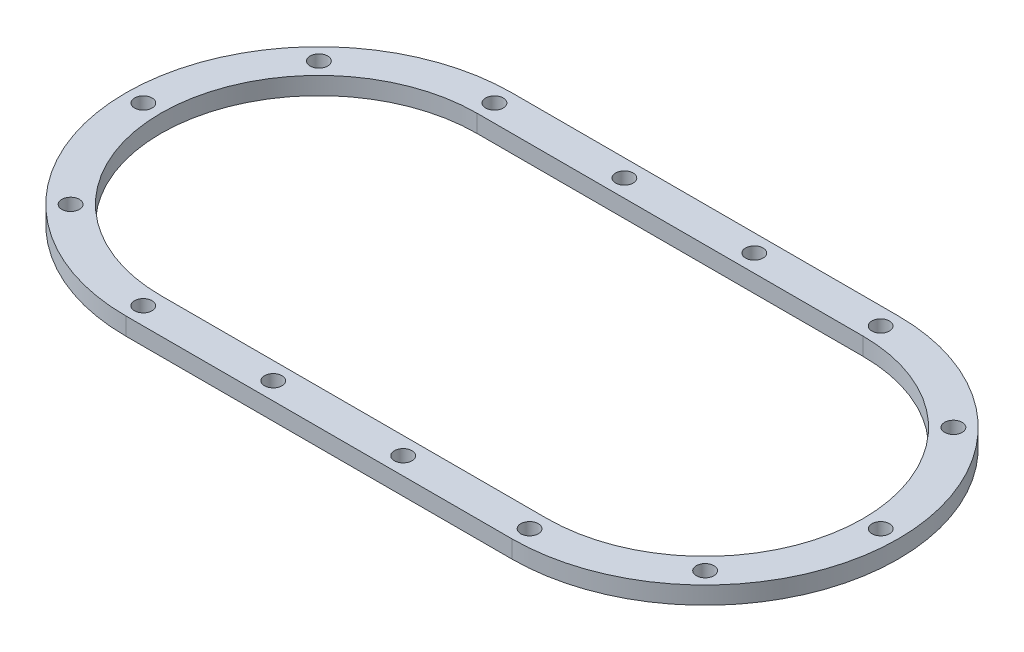
ISO-10303-21;
HEADER;
FILE_DESCRIPTION(('STEP AP214'),'2;1');
FILE_NAME('part.step','',(''),(''),'','','');
FILE_SCHEMA(('AUTOMOTIVE_DESIGN { 1 0 10303 214 1 1 1 1 }'));
ENDSEC;
DATA;
#1=APPLICATION_CONTEXT('core data for automotive mechanical design processes');
#2=APPLICATION_PROTOCOL_DEFINITION('international standard','automotive_design',2000,#1);
#3=PRODUCT_CONTEXT('',#1,'mechanical');
#4=PRODUCT('Part','Part','',(#3));
#5=PRODUCT_RELATED_PRODUCT_CATEGORY('part','',(#4));
#6=PRODUCT_DEFINITION_FORMATION('','',#4);
#7=PRODUCT_DEFINITION_CONTEXT('part definition',#1,'design');
#8=PRODUCT_DEFINITION('design','',#6,#7);
#9=PRODUCT_DEFINITION_SHAPE('','',#8);
#10=(LENGTH_UNIT() NAMED_UNIT(*) SI_UNIT(.MILLI.,.METRE.));
#11=(NAMED_UNIT(*) PLANE_ANGLE_UNIT() SI_UNIT($,.RADIAN.));
#12=(NAMED_UNIT(*) SI_UNIT($,.STERADIAN.) SOLID_ANGLE_UNIT());
#13=UNCERTAINTY_MEASURE_WITH_UNIT(LENGTH_MEASURE(1.E-05),#10,'distance_accuracy_value','');
#14=(GEOMETRIC_REPRESENTATION_CONTEXT(3) GLOBAL_UNCERTAINTY_ASSIGNED_CONTEXT((#13)) GLOBAL_UNIT_ASSIGNED_CONTEXT((#10,
#11,#12)) REPRESENTATION_CONTEXT('',''));
#15=CARTESIAN_POINT('',(0.,0.,0.));
#16=DIRECTION('',(0.,0.,1.));
#17=DIRECTION('',(1.,0.,0.));
#18=AXIS2_PLACEMENT_3D('',#15,#16,#17);
#19=CARTESIAN_POINT('',(-110.,10.,0.));
#20=DIRECTION('',(0.,1.,0.));
#21=DIRECTION('',(0.,0.,1.));
#22=AXIS2_PLACEMENT_3D('',#19,#20,#21);
#23=PLANE('',#22);
#24=CARTESIAN_POINT('',(38.,10.,100.));
#25=DIRECTION('',(0.,1.,0.));
#26=DIRECTION('',(0.,0.,1.));
#27=AXIS2_PLACEMENT_3D('',#24,#25,#26);
#28=CIRCLE('',#27,4.99999999999999);
#29=CARTESIAN_POINT('',(38.,10.,105.));
#30=VERTEX_POINT('',#29);
#31=EDGE_CURVE('E309',#30,#30,#28,.T.);
#32=ORIENTED_EDGE('',*,*,#31,.F.);
#33=EDGE_LOOP('',(#32));
#34=FACE_BOUND('',#33,.T.);
#35=CARTESIAN_POINT('',(-36.,10.,100.));
#36=DIRECTION('',(0.,1.,0.));
#37=DIRECTION('',(0.,0.,1.));
#38=AXIS2_PLACEMENT_3D('',#35,#36,#37);
#39=CIRCLE('',#38,4.99999999999999);
#40=CARTESIAN_POINT('',(-36.,10.,105.));
#41=VERTEX_POINT('',#40);
#42=EDGE_CURVE('E314',#41,#41,#39,.T.);
#43=ORIENTED_EDGE('',*,*,#42,.F.);
#44=EDGE_LOOP('',(#43));
#45=FACE_BOUND('',#44,.T.);
#46=CARTESIAN_POINT('',(38.,10.,-100.));
#47=DIRECTION('',(0.,1.,0.));
#48=DIRECTION('',(0.,0.,1.));
#49=AXIS2_PLACEMENT_3D('',#46,#47,#48);
#50=CIRCLE('',#49,4.99999999999999);
#51=CARTESIAN_POINT('',(38.,10.,-95.));
#52=VERTEX_POINT('',#51);
#53=EDGE_CURVE('E324',#52,#52,#50,.T.);
#54=ORIENTED_EDGE('',*,*,#53,.F.);
#55=EDGE_LOOP('',(#54));
#56=FACE_BOUND('',#55,.T.);
#57=CARTESIAN_POINT('',(-36.,10.,-100.));
#58=DIRECTION('',(0.,1.,0.));
#59=DIRECTION('',(0.,0.,1.));
#60=AXIS2_PLACEMENT_3D('',#57,#58,#59);
#61=CIRCLE('',#60,4.99999999999999);
#62=CARTESIAN_POINT('',(-36.,10.,-95.));
#63=VERTEX_POINT('',#62);
#64=EDGE_CURVE('E332',#63,#63,#61,.T.);
#65=ORIENTED_EDGE('',*,*,#64,.F.);
#66=EDGE_LOOP('',(#65));
#67=FACE_BOUND('',#66,.T.);
#68=CARTESIAN_POINT('',(110.,10.,100.));
#69=DIRECTION('',(0.,1.,0.));
#70=DIRECTION('',(0.,0.,1.));
#71=AXIS2_PLACEMENT_3D('',#68,#69,#70);
#72=CIRCLE('',#71,4.99999999999999);
#73=CARTESIAN_POINT('',(110.,10.,105.));
#74=VERTEX_POINT('',#73);
#75=EDGE_CURVE('E340',#74,#74,#72,.T.);
#76=ORIENTED_EDGE('',*,*,#75,.F.);
#77=EDGE_LOOP('',(#76));
#78=FACE_BOUND('',#77,.T.);
#79=CARTESIAN_POINT('',(180.710678118654,10.,70.7106781186551));
#80=DIRECTION('',(0.,1.,0.));
#81=DIRECTION('',(0.,0.,1.));
#82=AXIS2_PLACEMENT_3D('',#79,#80,#81);
#83=CIRCLE('',#82,4.99999999999998);
#84=CARTESIAN_POINT('',(180.710678118654,10.,75.7106781186551));
#85=VERTEX_POINT('',#84);
#86=EDGE_CURVE('E348',#85,#85,#83,.T.);
#87=ORIENTED_EDGE('',*,*,#86,.F.);
#88=EDGE_LOOP('',(#87));
#89=FACE_BOUND('',#88,.T.);
#90=CARTESIAN_POINT('',(210.,10.,3.60822483003176E-13));
#91=DIRECTION('',(0.,1.,0.));
#92=DIRECTION('',(0.,0.,1.));
#93=AXIS2_PLACEMENT_3D('',#90,#91,#92);
#94=CIRCLE('',#93,4.99999999999998);
#95=CARTESIAN_POINT('',(210.,10.,5.00000000000034));
#96=VERTEX_POINT('',#95);
#97=EDGE_CURVE('E356',#96,#96,#94,.T.);
#98=ORIENTED_EDGE('',*,*,#97,.F.);
#99=EDGE_LOOP('',(#98));
#100=FACE_BOUND('',#99,.T.);
#101=CARTESIAN_POINT('',(180.710678118655,10.,-70.7106781186546));
#102=DIRECTION('',(0.,1.,0.));
#103=DIRECTION('',(0.,0.,1.));
#104=AXIS2_PLACEMENT_3D('',#101,#102,#103);
#105=CIRCLE('',#104,4.99999999999998);
#106=CARTESIAN_POINT('',(180.710678118655,10.,-65.7106781186546));
#107=VERTEX_POINT('',#106);
#108=EDGE_CURVE('E364',#107,#107,#105,.T.);
#109=ORIENTED_EDGE('',*,*,#108,.F.);
#110=EDGE_LOOP('',(#109));
#111=FACE_BOUND('',#110,.T.);
#112=CARTESIAN_POINT('',(110.,10.,-100.));
#113=DIRECTION('',(0.,1.,0.));
#114=DIRECTION('',(0.,0.,1.));
#115=AXIS2_PLACEMENT_3D('',#112,#113,#114);
#116=CIRCLE('',#115,4.99999999999999);
#117=CARTESIAN_POINT('',(110.,10.,-95.));
#118=VERTEX_POINT('',#117);
#119=EDGE_CURVE('E372',#118,#118,#116,.T.);
#120=ORIENTED_EDGE('',*,*,#119,.F.);
#121=EDGE_LOOP('',(#120));
#122=FACE_BOUND('',#121,.T.);
#123=CARTESIAN_POINT('',(-110.,10.,100.));
#124=DIRECTION('',(0.,1.,0.));
#125=DIRECTION('',(0.,0.,1.));
#126=AXIS2_PLACEMENT_3D('',#123,#124,#125);
#127=CIRCLE('',#126,4.99999999999999);
#128=CARTESIAN_POINT('',(-110.,10.,105.));
#129=VERTEX_POINT('',#128);
#130=EDGE_CURVE('E380',#129,#129,#127,.T.);
#131=ORIENTED_EDGE('',*,*,#130,.F.);
#132=EDGE_LOOP('',(#131));
#133=FACE_BOUND('',#132,.T.);
#134=CARTESIAN_POINT('',(-180.710678118654,10.,70.7106781186551));
#135=DIRECTION('',(0.,1.,0.));
#136=DIRECTION('',(0.,0.,1.));
#137=AXIS2_PLACEMENT_3D('',#134,#135,#136);
#138=CIRCLE('',#137,4.99999999999998);
#139=CARTESIAN_POINT('',(-180.710678118654,10.,75.7106781186551));
#140=VERTEX_POINT('',#139);
#141=EDGE_CURVE('E388',#140,#140,#138,.T.);
#142=ORIENTED_EDGE('',*,*,#141,.F.);
#143=EDGE_LOOP('',(#142));
#144=FACE_BOUND('',#143,.T.);
#145=CARTESIAN_POINT('',(-210.,10.,3.60822483003176E-13));
#146=DIRECTION('',(0.,1.,0.));
#147=DIRECTION('',(0.,0.,1.));
#148=AXIS2_PLACEMENT_3D('',#145,#146,#147);
#149=CIRCLE('',#148,4.99999999999998);
#150=CARTESIAN_POINT('',(-210.,10.,5.00000000000034));
#151=VERTEX_POINT('',#150);
#152=EDGE_CURVE('E396',#151,#151,#149,.T.);
#153=ORIENTED_EDGE('',*,*,#152,.F.);
#154=EDGE_LOOP('',(#153));
#155=FACE_BOUND('',#154,.T.);
#156=CARTESIAN_POINT('',(-180.710678118655,10.,-70.7106781186546));
#157=DIRECTION('',(0.,1.,0.));
#158=DIRECTION('',(0.,0.,1.));
#159=AXIS2_PLACEMENT_3D('',#156,#157,#158);
#160=CIRCLE('',#159,4.99999999999998);
#161=CARTESIAN_POINT('',(-180.710678118655,10.,-65.7106781186546));
#162=VERTEX_POINT('',#161);
#163=EDGE_CURVE('E404',#162,#162,#160,.T.);
#164=ORIENTED_EDGE('',*,*,#163,.F.);
#165=EDGE_LOOP('',(#164));
#166=FACE_BOUND('',#165,.T.);
#167=CARTESIAN_POINT('',(-110.,10.,-100.));
#168=DIRECTION('',(0.,1.,0.));
#169=DIRECTION('',(0.,0.,1.));
#170=AXIS2_PLACEMENT_3D('',#167,#168,#169);
#171=CIRCLE('',#170,4.99999999999999);
#172=CARTESIAN_POINT('',(-110.,10.,-95.));
#173=VERTEX_POINT('',#172);
#174=EDGE_CURVE('E412',#173,#173,#171,.T.);
#175=ORIENTED_EDGE('',*,*,#174,.F.);
#176=EDGE_LOOP('',(#175));
#177=FACE_BOUND('',#176,.T.);
#178=CARTESIAN_POINT('',(-110.,10.,0.));
#179=DIRECTION('',(0.,1.,0.));
#180=DIRECTION('',(0.,0.,1.));
#181=AXIS2_PLACEMENT_3D('',#178,#179,#180);
#182=CIRCLE('',#181,110.);
#183=CARTESIAN_POINT('',(-110.,10.,-110.));
#184=VERTEX_POINT('',#183);
#185=CARTESIAN_POINT('',(-110.,10.,110.));
#186=VERTEX_POINT('',#185);
#187=EDGE_CURVE('E155',#184,#186,#182,.T.);
#188=ORIENTED_EDGE('',*,*,#187,.T.);
#189=DIRECTION('',(1.,0.,0.));
#190=VECTOR('',#189,1.);
#191=CARTESIAN_POINT('',(-110.,10.,110.));
#192=LINE('',#191,#190);
#193=CARTESIAN_POINT('',(110.,10.,110.));
#194=VERTEX_POINT('',#193);
#195=EDGE_CURVE('E159',#186,#194,#192,.T.);
#196=ORIENTED_EDGE('',*,*,#195,.T.);
#197=CARTESIAN_POINT('',(110.,10.,0.));
#198=DIRECTION('',(0.,1.,0.));
#199=DIRECTION('',(0.,0.,1.));
#200=AXIS2_PLACEMENT_3D('',#197,#198,#199);
#201=CIRCLE('',#200,110.);
#202=CARTESIAN_POINT('',(110.,10.,-110.));
#203=VERTEX_POINT('',#202);
#204=EDGE_CURVE('E163',#194,#203,#201,.T.);
#205=ORIENTED_EDGE('',*,*,#204,.T.);
#206=DIRECTION('',(-1.,0.,0.));
#207=VECTOR('',#206,1.);
#208=CARTESIAN_POINT('',(-110.,10.,-110.));
#209=LINE('',#208,#207);
#210=EDGE_CURVE('E166',#203,#184,#209,.T.);
#211=ORIENTED_EDGE('',*,*,#210,.T.);
#212=EDGE_LOOP('',(#188,#196,#205,#211));
#213=FACE_BOUND('',#212,.T.);
#214=DIRECTION('',(1.,0.,0.));
#215=VECTOR('',#214,1.);
#216=CARTESIAN_POINT('',(-110.,10.,90.));
#217=LINE('',#216,#215);
#218=CARTESIAN_POINT('',(-110.,10.,90.));
#219=VERTEX_POINT('',#218);
#220=CARTESIAN_POINT('',(110.,10.,90.));
#221=VERTEX_POINT('',#220);
#222=EDGE_CURVE('E113',#219,#221,#217,.T.);
#223=ORIENTED_EDGE('',*,*,#222,.F.);
#224=CARTESIAN_POINT('',(-110.,10.,0.));
#225=DIRECTION('',(0.,1.,0.));
#226=DIRECTION('',(0.,0.,1.));
#227=AXIS2_PLACEMENT_3D('',#224,#225,#226);
#228=CIRCLE('',#227,90.);
#229=CARTESIAN_POINT('',(-110.,10.,-90.));
#230=VERTEX_POINT('',#229);
#231=EDGE_CURVE('E104',#230,#219,#228,.T.);
#232=ORIENTED_EDGE('',*,*,#231,.F.);
#233=DIRECTION('',(-1.,0.,0.));
#234=VECTOR('',#233,1.);
#235=CARTESIAN_POINT('',(-110.,10.,-90.));
#236=LINE('',#235,#234);
#237=CARTESIAN_POINT('',(110.,10.,-90.));
#238=VERTEX_POINT('',#237);
#239=EDGE_CURVE('E131',#238,#230,#236,.T.);
#240=ORIENTED_EDGE('',*,*,#239,.F.);
#241=CARTESIAN_POINT('',(110.,10.,0.));
#242=DIRECTION('',(0.,1.,0.));
#243=DIRECTION('',(0.,0.,1.));
#244=AXIS2_PLACEMENT_3D('',#241,#242,#243);
#245=CIRCLE('',#244,90.);
#246=EDGE_CURVE('E126',#221,#238,#245,.T.);
#247=ORIENTED_EDGE('',*,*,#246,.F.);
#248=EDGE_LOOP('',(#223,#232,#240,#247));
#249=FACE_BOUND('',#248,.T.);
#250=ADVANCED_FACE('F38',(#34,#45,#56,#67,#78,#89,#100,#111,#122,#133,#144,#155,#166,#177,#213,
#249),#23,.T.);
#251=CARTESIAN_POINT('',(-110.,0.,0.));
#252=DIRECTION('',(0.,1.,0.));
#253=DIRECTION('',(0.,0.,1.));
#254=AXIS2_PLACEMENT_3D('',#251,#252,#253);
#255=PLANE('',#254);
#256=CARTESIAN_POINT('',(38.,0.,100.));
#257=DIRECTION('',(0.,1.,0.));
#258=DIRECTION('',(0.,0.,1.));
#259=AXIS2_PLACEMENT_3D('',#256,#257,#258);
#260=CIRCLE('',#259,4.99999999999999);
#261=CARTESIAN_POINT('',(38.,0.,105.));
#262=VERTEX_POINT('',#261);
#263=EDGE_CURVE('E307',#262,#262,#260,.T.);
#264=ORIENTED_EDGE('',*,*,#263,.T.);
#265=EDGE_LOOP('',(#264));
#266=FACE_BOUND('',#265,.T.);
#267=CARTESIAN_POINT('',(-36.,0.,100.));
#268=DIRECTION('',(0.,1.,0.));
#269=DIRECTION('',(0.,0.,1.));
#270=AXIS2_PLACEMENT_3D('',#267,#268,#269);
#271=CIRCLE('',#270,4.99999999999999);
#272=CARTESIAN_POINT('',(-36.,0.,105.));
#273=VERTEX_POINT('',#272);
#274=EDGE_CURVE('E320',#273,#273,#271,.T.);
#275=ORIENTED_EDGE('',*,*,#274,.T.);
#276=EDGE_LOOP('',(#275));
#277=FACE_BOUND('',#276,.T.);
#278=CARTESIAN_POINT('',(38.,0.,-100.));
#279=DIRECTION('',(0.,1.,0.));
#280=DIRECTION('',(0.,0.,1.));
#281=AXIS2_PLACEMENT_3D('',#278,#279,#280);
#282=CIRCLE('',#281,4.99999999999999);
#283=CARTESIAN_POINT('',(38.,0.,-95.));
#284=VERTEX_POINT('',#283);
#285=EDGE_CURVE('E328',#284,#284,#282,.T.);
#286=ORIENTED_EDGE('',*,*,#285,.T.);
#287=EDGE_LOOP('',(#286));
#288=FACE_BOUND('',#287,.T.);
#289=CARTESIAN_POINT('',(-36.,0.,-100.));
#290=DIRECTION('',(0.,1.,0.));
#291=DIRECTION('',(0.,0.,1.));
#292=AXIS2_PLACEMENT_3D('',#289,#290,#291);
#293=CIRCLE('',#292,4.99999999999999);
#294=CARTESIAN_POINT('',(-36.,0.,-95.));
#295=VERTEX_POINT('',#294);
#296=EDGE_CURVE('E336',#295,#295,#293,.T.);
#297=ORIENTED_EDGE('',*,*,#296,.T.);
#298=EDGE_LOOP('',(#297));
#299=FACE_BOUND('',#298,.T.);
#300=CARTESIAN_POINT('',(110.,0.,100.));
#301=DIRECTION('',(0.,1.,0.));
#302=DIRECTION('',(0.,0.,1.));
#303=AXIS2_PLACEMENT_3D('',#300,#301,#302);
#304=CIRCLE('',#303,4.99999999999999);
#305=CARTESIAN_POINT('',(110.,0.,105.));
#306=VERTEX_POINT('',#305);
#307=EDGE_CURVE('E344',#306,#306,#304,.T.);
#308=ORIENTED_EDGE('',*,*,#307,.T.);
#309=EDGE_LOOP('',(#308));
#310=FACE_BOUND('',#309,.T.);
#311=CARTESIAN_POINT('',(180.710678118654,0.,70.7106781186551));
#312=DIRECTION('',(0.,1.,0.));
#313=DIRECTION('',(0.,0.,1.));
#314=AXIS2_PLACEMENT_3D('',#311,#312,#313);
#315=CIRCLE('',#314,4.99999999999998);
#316=CARTESIAN_POINT('',(180.710678118654,0.,75.7106781186551));
#317=VERTEX_POINT('',#316);
#318=EDGE_CURVE('E352',#317,#317,#315,.T.);
#319=ORIENTED_EDGE('',*,*,#318,.T.);
#320=EDGE_LOOP('',(#319));
#321=FACE_BOUND('',#320,.T.);
#322=CARTESIAN_POINT('',(210.,0.,3.60822483003176E-13));
#323=DIRECTION('',(0.,1.,0.));
#324=DIRECTION('',(0.,0.,1.));
#325=AXIS2_PLACEMENT_3D('',#322,#323,#324);
#326=CIRCLE('',#325,4.99999999999998);
#327=CARTESIAN_POINT('',(210.,0.,5.00000000000034));
#328=VERTEX_POINT('',#327);
#329=EDGE_CURVE('E360',#328,#328,#326,.T.);
#330=ORIENTED_EDGE('',*,*,#329,.T.);
#331=EDGE_LOOP('',(#330));
#332=FACE_BOUND('',#331,.T.);
#333=CARTESIAN_POINT('',(180.710678118655,0.,-70.7106781186546));
#334=DIRECTION('',(0.,1.,0.));
#335=DIRECTION('',(0.,0.,1.));
#336=AXIS2_PLACEMENT_3D('',#333,#334,#335);
#337=CIRCLE('',#336,4.99999999999998);
#338=CARTESIAN_POINT('',(180.710678118655,0.,-65.7106781186546));
#339=VERTEX_POINT('',#338);
#340=EDGE_CURVE('E368',#339,#339,#337,.T.);
#341=ORIENTED_EDGE('',*,*,#340,.T.);
#342=EDGE_LOOP('',(#341));
#343=FACE_BOUND('',#342,.T.);
#344=CARTESIAN_POINT('',(110.,0.,-100.));
#345=DIRECTION('',(0.,1.,0.));
#346=DIRECTION('',(0.,0.,1.));
#347=AXIS2_PLACEMENT_3D('',#344,#345,#346);
#348=CIRCLE('',#347,4.99999999999999);
#349=CARTESIAN_POINT('',(110.,0.,-95.));
#350=VERTEX_POINT('',#349);
#351=EDGE_CURVE('E376',#350,#350,#348,.T.);
#352=ORIENTED_EDGE('',*,*,#351,.T.);
#353=EDGE_LOOP('',(#352));
#354=FACE_BOUND('',#353,.T.);
#355=CARTESIAN_POINT('',(-110.,0.,100.));
#356=DIRECTION('',(0.,1.,0.));
#357=DIRECTION('',(0.,0.,1.));
#358=AXIS2_PLACEMENT_3D('',#355,#356,#357);
#359=CIRCLE('',#358,4.99999999999999);
#360=CARTESIAN_POINT('',(-110.,0.,105.));
#361=VERTEX_POINT('',#360);
#362=EDGE_CURVE('E384',#361,#361,#359,.T.);
#363=ORIENTED_EDGE('',*,*,#362,.T.);
#364=EDGE_LOOP('',(#363));
#365=FACE_BOUND('',#364,.T.);
#366=CARTESIAN_POINT('',(-180.710678118654,0.,70.7106781186551));
#367=DIRECTION('',(0.,1.,0.));
#368=DIRECTION('',(0.,0.,1.));
#369=AXIS2_PLACEMENT_3D('',#366,#367,#368);
#370=CIRCLE('',#369,4.99999999999998);
#371=CARTESIAN_POINT('',(-180.710678118654,0.,75.7106781186551));
#372=VERTEX_POINT('',#371);
#373=EDGE_CURVE('E392',#372,#372,#370,.T.);
#374=ORIENTED_EDGE('',*,*,#373,.T.);
#375=EDGE_LOOP('',(#374));
#376=FACE_BOUND('',#375,.T.);
#377=CARTESIAN_POINT('',(-210.,0.,3.60822483003176E-13));
#378=DIRECTION('',(0.,1.,0.));
#379=DIRECTION('',(0.,0.,1.));
#380=AXIS2_PLACEMENT_3D('',#377,#378,#379);
#381=CIRCLE('',#380,4.99999999999998);
#382=CARTESIAN_POINT('',(-210.,0.,5.00000000000034));
#383=VERTEX_POINT('',#382);
#384=EDGE_CURVE('E400',#383,#383,#381,.T.);
#385=ORIENTED_EDGE('',*,*,#384,.T.);
#386=EDGE_LOOP('',(#385));
#387=FACE_BOUND('',#386,.T.);
#388=CARTESIAN_POINT('',(-180.710678118655,0.,-70.7106781186546));
#389=DIRECTION('',(0.,1.,0.));
#390=DIRECTION('',(0.,0.,1.));
#391=AXIS2_PLACEMENT_3D('',#388,#389,#390);
#392=CIRCLE('',#391,4.99999999999998);
#393=CARTESIAN_POINT('',(-180.710678118655,0.,-65.7106781186546));
#394=VERTEX_POINT('',#393);
#395=EDGE_CURVE('E408',#394,#394,#392,.T.);
#396=ORIENTED_EDGE('',*,*,#395,.T.);
#397=EDGE_LOOP('',(#396));
#398=FACE_BOUND('',#397,.T.);
#399=CARTESIAN_POINT('',(-110.,0.,-100.));
#400=DIRECTION('',(0.,1.,0.));
#401=DIRECTION('',(0.,0.,1.));
#402=AXIS2_PLACEMENT_3D('',#399,#400,#401);
#403=CIRCLE('',#402,4.99999999999999);
#404=CARTESIAN_POINT('',(-110.,0.,-95.));
#405=VERTEX_POINT('',#404);
#406=EDGE_CURVE('E139',#405,#405,#403,.T.);
#407=ORIENTED_EDGE('',*,*,#406,.T.);
#408=EDGE_LOOP('',(#407));
#409=FACE_BOUND('',#408,.T.);
#410=CARTESIAN_POINT('',(-110.,0.,0.));
#411=DIRECTION('',(0.,1.,0.));
#412=DIRECTION('',(0.,0.,1.));
#413=AXIS2_PLACEMENT_3D('',#410,#411,#412);
#414=CIRCLE('',#413,110.);
#415=CARTESIAN_POINT('',(-110.,0.,-110.));
#416=VERTEX_POINT('',#415);
#417=CARTESIAN_POINT('',(-110.,0.,110.));
#418=VERTEX_POINT('',#417);
#419=EDGE_CURVE('E122',#416,#418,#414,.T.);
#420=ORIENTED_EDGE('',*,*,#419,.F.);
#421=DIRECTION('',(-1.,0.,0.));
#422=VECTOR('',#421,1.);
#423=CARTESIAN_POINT('',(-110.,0.,-110.));
#424=LINE('',#423,#422);
#425=CARTESIAN_POINT('',(110.,0.,-110.));
#426=VERTEX_POINT('',#425);
#427=EDGE_CURVE('E160',#426,#416,#424,.T.);
#428=ORIENTED_EDGE('',*,*,#427,.F.);
#429=CARTESIAN_POINT('',(110.,0.,0.));
#430=DIRECTION('',(0.,1.,0.));
#431=DIRECTION('',(0.,0.,1.));
#432=AXIS2_PLACEMENT_3D('',#429,#430,#431);
#433=CIRCLE('',#432,110.);
#434=CARTESIAN_POINT('',(110.,0.,110.));
#435=VERTEX_POINT('',#434);
#436=EDGE_CURVE('E176',#435,#426,#433,.T.);
#437=ORIENTED_EDGE('',*,*,#436,.F.);
#438=DIRECTION('',(1.,0.,0.));
#439=VECTOR('',#438,1.);
#440=CARTESIAN_POINT('',(-110.,0.,110.));
#441=LINE('',#440,#439);
#442=EDGE_CURVE('E173',#418,#435,#441,.T.);
#443=ORIENTED_EDGE('',*,*,#442,.F.);
#444=EDGE_LOOP('',(#420,#428,#437,#443));
#445=FACE_BOUND('',#444,.T.);
#446=CARTESIAN_POINT('',(-110.,0.,0.));
#447=DIRECTION('',(0.,1.,0.));
#448=DIRECTION('',(0.,0.,1.));
#449=AXIS2_PLACEMENT_3D('',#446,#447,#448);
#450=CIRCLE('',#449,90.);
#451=CARTESIAN_POINT('',(-110.,0.,-90.));
#452=VERTEX_POINT('',#451);
#453=CARTESIAN_POINT('',(-110.,0.,90.));
#454=VERTEX_POINT('',#453);
#455=EDGE_CURVE('E62',#452,#454,#450,.T.);
#456=ORIENTED_EDGE('',*,*,#455,.T.);
#457=DIRECTION('',(1.,0.,0.));
#458=VECTOR('',#457,1.);
#459=CARTESIAN_POINT('',(-110.,0.,90.));
#460=LINE('',#459,#458);
#461=CARTESIAN_POINT('',(110.,0.,90.));
#462=VERTEX_POINT('',#461);
#463=EDGE_CURVE('E120',#454,#462,#460,.T.);
#464=ORIENTED_EDGE('',*,*,#463,.T.);
#465=CARTESIAN_POINT('',(110.,0.,0.));
#466=DIRECTION('',(0.,1.,0.));
#467=DIRECTION('',(0.,0.,1.));
#468=AXIS2_PLACEMENT_3D('',#465,#466,#467);
#469=CIRCLE('',#468,90.);
#470=CARTESIAN_POINT('',(110.,0.,-90.));
#471=VERTEX_POINT('',#470);
#472=EDGE_CURVE('E142',#462,#471,#469,.T.);
#473=ORIENTED_EDGE('',*,*,#472,.T.);
#474=DIRECTION('',(-1.,0.,0.));
#475=VECTOR('',#474,1.);
#476=CARTESIAN_POINT('',(-110.,0.,-90.));
#477=LINE('',#476,#475);
#478=EDGE_CURVE('E114',#471,#452,#477,.T.);
#479=ORIENTED_EDGE('',*,*,#478,.T.);
#480=EDGE_LOOP('',(#456,#464,#473,#479));
#481=FACE_BOUND('',#480,.T.);
#482=ADVANCED_FACE('F200',(#266,#277,#288,#299,#310,#321,#332,#343,#354,#365,#376,#387,#398,
#409,#445,#481),#255,.F.);
#483=CARTESIAN_POINT('',(-110.,10.,0.));
#484=DIRECTION('',(0.,-1.,0.));
#485=DIRECTION('',(0.,0.,-1.));
#486=AXIS2_PLACEMENT_3D('',#483,#484,#485);
#487=CYLINDRICAL_SURFACE('',#486,110.);
#488=ORIENTED_EDGE('',*,*,#419,.T.);
#489=DIRECTION('',(0.,-1.,0.));
#490=VECTOR('',#489,1.);
#491=CARTESIAN_POINT('',(-110.,10.,110.));
#492=LINE('',#491,#490);
#493=EDGE_CURVE('E11',#186,#418,#492,.T.);
#494=ORIENTED_EDGE('',*,*,#493,.F.);
#495=ORIENTED_EDGE('',*,*,#187,.F.);
#496=DIRECTION('',(0.,-1.,0.));
#497=VECTOR('',#496,1.);
#498=CARTESIAN_POINT('',(-110.,10.,-110.));
#499=LINE('',#498,#497);
#500=EDGE_CURVE('E169',#184,#416,#499,.T.);
#501=ORIENTED_EDGE('',*,*,#500,.T.);
#502=EDGE_LOOP('',(#488,#494,#495,#501));
#503=FACE_BOUND('',#502,.T.);
#504=ADVANCED_FACE('F40',(#503),#487,.T.);
#505=CARTESIAN_POINT('',(-110.,10.,110.));
#506=DIRECTION('',(0.,0.,-1.));
#507=DIRECTION('',(-1.,0.,0.));
#508=AXIS2_PLACEMENT_3D('',#505,#506,#507);
#509=PLANE('',#508);
#510=ORIENTED_EDGE('',*,*,#442,.T.);
#511=DIRECTION('',(0.,-1.,0.));
#512=VECTOR('',#511,1.);
#513=CARTESIAN_POINT('',(110.,10.,110.));
#514=LINE('',#513,#512);
#515=EDGE_CURVE('E47',#194,#435,#514,.T.);
#516=ORIENTED_EDGE('',*,*,#515,.F.);
#517=ORIENTED_EDGE('',*,*,#195,.F.);
#518=ORIENTED_EDGE('',*,*,#493,.T.);
#519=EDGE_LOOP('',(#510,#516,#517,#518));
#520=FACE_BOUND('',#519,.T.);
#521=ADVANCED_FACE('F210',(#520),#509,.F.);
#522=CARTESIAN_POINT('',(110.,10.,0.));
#523=DIRECTION('',(0.,-1.,0.));
#524=DIRECTION('',(0.,0.,-1.));
#525=AXIS2_PLACEMENT_3D('',#522,#523,#524);
#526=CYLINDRICAL_SURFACE('',#525,110.);
#527=ORIENTED_EDGE('',*,*,#436,.T.);
#528=DIRECTION('',(0.,-1.,0.));
#529=VECTOR('',#528,1.);
#530=CARTESIAN_POINT('',(110.,10.,-110.));
#531=LINE('',#530,#529);
#532=EDGE_CURVE('E184',#203,#426,#531,.T.);
#533=ORIENTED_EDGE('',*,*,#532,.F.);
#534=ORIENTED_EDGE('',*,*,#204,.F.);
#535=ORIENTED_EDGE('',*,*,#515,.T.);
#536=EDGE_LOOP('',(#527,#533,#534,#535));
#537=FACE_BOUND('',#536,.T.);
#538=ADVANCED_FACE('F194',(#537),#526,.T.);
#539=CARTESIAN_POINT('',(-110.,10.,-110.));
#540=DIRECTION('',(0.,0.,1.));
#541=DIRECTION('',(1.,0.,0.));
#542=AXIS2_PLACEMENT_3D('',#539,#540,#541);
#543=PLANE('',#542);
#544=ORIENTED_EDGE('',*,*,#427,.T.);
#545=ORIENTED_EDGE('',*,*,#500,.F.);
#546=ORIENTED_EDGE('',*,*,#210,.F.);
#547=ORIENTED_EDGE('',*,*,#532,.T.);
#548=EDGE_LOOP('',(#544,#545,#546,#547));
#549=FACE_BOUND('',#548,.T.);
#550=ADVANCED_FACE('F204',(#549),#543,.F.);
#551=CARTESIAN_POINT('',(-110.,10.,0.));
#552=DIRECTION('',(0.,-1.,0.));
#553=DIRECTION('',(0.,0.,-1.));
#554=AXIS2_PLACEMENT_3D('',#551,#552,#553);
#555=CYLINDRICAL_SURFACE('',#554,90.);
#556=ORIENTED_EDGE('',*,*,#455,.F.);
#557=DIRECTION('',(0.,-1.,0.));
#558=VECTOR('',#557,1.);
#559=CARTESIAN_POINT('',(-110.,10.,-90.));
#560=LINE('',#559,#558);
#561=EDGE_CURVE('E108',#230,#452,#560,.T.);
#562=ORIENTED_EDGE('',*,*,#561,.F.);
#563=ORIENTED_EDGE('',*,*,#231,.T.);
#564=DIRECTION('',(0.,-1.,0.));
#565=VECTOR('',#564,1.);
#566=CARTESIAN_POINT('',(-110.,10.,90.));
#567=LINE('',#566,#565);
#568=EDGE_CURVE('E107',#219,#454,#567,.T.);
#569=ORIENTED_EDGE('',*,*,#568,.T.);
#570=EDGE_LOOP('',(#556,#562,#563,#569));
#571=FACE_BOUND('',#570,.T.);
#572=ADVANCED_FACE('F106',(#571),#555,.F.);
#573=CARTESIAN_POINT('',(-110.,10.,90.));
#574=DIRECTION('',(0.,0.,-1.));
#575=DIRECTION('',(-1.,0.,0.));
#576=AXIS2_PLACEMENT_3D('',#573,#574,#575);
#577=PLANE('',#576);
#578=ORIENTED_EDGE('',*,*,#463,.F.);
#579=ORIENTED_EDGE('',*,*,#568,.F.);
#580=ORIENTED_EDGE('',*,*,#222,.T.);
#581=DIRECTION('',(0.,-1.,0.));
#582=VECTOR('',#581,1.);
#583=CARTESIAN_POINT('',(110.,10.,90.));
#584=LINE('',#583,#582);
#585=EDGE_CURVE('E123',#221,#462,#584,.T.);
#586=ORIENTED_EDGE('',*,*,#585,.T.);
#587=EDGE_LOOP('',(#578,#579,#580,#586));
#588=FACE_BOUND('',#587,.T.);
#589=ADVANCED_FACE('F117',(#588),#577,.T.);
#590=CARTESIAN_POINT('',(110.,10.,0.));
#591=DIRECTION('',(0.,-1.,0.));
#592=DIRECTION('',(0.,0.,-1.));
#593=AXIS2_PLACEMENT_3D('',#590,#591,#592);
#594=CYLINDRICAL_SURFACE('',#593,90.);
#595=ORIENTED_EDGE('',*,*,#472,.F.);
#596=ORIENTED_EDGE('',*,*,#585,.F.);
#597=ORIENTED_EDGE('',*,*,#246,.T.);
#598=DIRECTION('',(0.,-1.,0.));
#599=VECTOR('',#598,1.);
#600=CARTESIAN_POINT('',(110.,10.,-90.));
#601=LINE('',#600,#599);
#602=EDGE_CURVE('E54',#238,#471,#601,.T.);
#603=ORIENTED_EDGE('',*,*,#602,.T.);
#604=EDGE_LOOP('',(#595,#596,#597,#603));
#605=FACE_BOUND('',#604,.T.);
#606=ADVANCED_FACE('F237',(#605),#594,.F.);
#607=CARTESIAN_POINT('',(-110.,10.,-90.));
#608=DIRECTION('',(0.,0.,1.));
#609=DIRECTION('',(1.,0.,0.));
#610=AXIS2_PLACEMENT_3D('',#607,#608,#609);
#611=PLANE('',#610);
#612=ORIENTED_EDGE('',*,*,#478,.F.);
#613=ORIENTED_EDGE('',*,*,#602,.F.);
#614=ORIENTED_EDGE('',*,*,#239,.T.);
#615=ORIENTED_EDGE('',*,*,#561,.T.);
#616=EDGE_LOOP('',(#612,#613,#614,#615));
#617=FACE_BOUND('',#616,.T.);
#618=ADVANCED_FACE('F241',(#617),#611,.T.);
#619=CARTESIAN_POINT('',(-110.,10.,-100.));
#620=DIRECTION('',(0.,1.,0.));
#621=DIRECTION('',(0.,0.,1.));
#622=AXIS2_PLACEMENT_3D('',#619,#620,#621);
#623=CYLINDRICAL_SURFACE('',#622,4.99999999999999);
#624=ORIENTED_EDGE('',*,*,#406,.F.);
#625=EDGE_LOOP('',(#624));
#626=FACE_BOUND('',#625,.T.);
#627=ORIENTED_EDGE('',*,*,#174,.T.);
#628=EDGE_LOOP('',(#627));
#629=FACE_BOUND('',#628,.T.);
#630=ADVANCED_FACE('F247',(#626,#629),#623,.F.);
#631=CARTESIAN_POINT('',(-180.710678118655,10.,-70.7106781186546));
#632=DIRECTION('',(0.,1.,0.));
#633=DIRECTION('',(0.,0.,1.));
#634=AXIS2_PLACEMENT_3D('',#631,#632,#633);
#635=CYLINDRICAL_SURFACE('',#634,4.99999999999998);
#636=ORIENTED_EDGE('',*,*,#395,.F.);
#637=EDGE_LOOP('',(#636));
#638=FACE_BOUND('',#637,.T.);
#639=ORIENTED_EDGE('',*,*,#163,.T.);
#640=EDGE_LOOP('',(#639));
#641=FACE_BOUND('',#640,.T.);
#642=ADVANCED_FACE('F250',(#638,#641),#635,.F.);
#643=CARTESIAN_POINT('',(-210.,10.,3.60822483003176E-13));
#644=DIRECTION('',(0.,1.,0.));
#645=DIRECTION('',(0.,0.,1.));
#646=AXIS2_PLACEMENT_3D('',#643,#644,#645);
#647=CYLINDRICAL_SURFACE('',#646,4.99999999999998);
#648=ORIENTED_EDGE('',*,*,#384,.F.);
#649=EDGE_LOOP('',(#648));
#650=FACE_BOUND('',#649,.T.);
#651=ORIENTED_EDGE('',*,*,#152,.T.);
#652=EDGE_LOOP('',(#651));
#653=FACE_BOUND('',#652,.T.);
#654=ADVANCED_FACE('F254',(#650,#653),#647,.F.);
#655=CARTESIAN_POINT('',(-180.710678118654,10.,70.7106781186551));
#656=DIRECTION('',(0.,1.,0.));
#657=DIRECTION('',(0.,0.,1.));
#658=AXIS2_PLACEMENT_3D('',#655,#656,#657);
#659=CYLINDRICAL_SURFACE('',#658,4.99999999999998);
#660=ORIENTED_EDGE('',*,*,#373,.F.);
#661=EDGE_LOOP('',(#660));
#662=FACE_BOUND('',#661,.T.);
#663=ORIENTED_EDGE('',*,*,#141,.T.);
#664=EDGE_LOOP('',(#663));
#665=FACE_BOUND('',#664,.T.);
#666=ADVANCED_FACE('F258',(#662,#665),#659,.F.);
#667=CARTESIAN_POINT('',(-110.,10.,100.));
#668=DIRECTION('',(0.,1.,0.));
#669=DIRECTION('',(0.,0.,1.));
#670=AXIS2_PLACEMENT_3D('',#667,#668,#669);
#671=CYLINDRICAL_SURFACE('',#670,4.99999999999999);
#672=ORIENTED_EDGE('',*,*,#362,.F.);
#673=EDGE_LOOP('',(#672));
#674=FACE_BOUND('',#673,.T.);
#675=ORIENTED_EDGE('',*,*,#130,.T.);
#676=EDGE_LOOP('',(#675));
#677=FACE_BOUND('',#676,.T.);
#678=ADVANCED_FACE('F262',(#674,#677),#671,.F.);
#679=CARTESIAN_POINT('',(110.,10.,-100.));
#680=DIRECTION('',(0.,1.,0.));
#681=DIRECTION('',(0.,0.,1.));
#682=AXIS2_PLACEMENT_3D('',#679,#680,#681);
#683=CYLINDRICAL_SURFACE('',#682,4.99999999999999);
#684=ORIENTED_EDGE('',*,*,#351,.F.);
#685=EDGE_LOOP('',(#684));
#686=FACE_BOUND('',#685,.T.);
#687=ORIENTED_EDGE('',*,*,#119,.T.);
#688=EDGE_LOOP('',(#687));
#689=FACE_BOUND('',#688,.T.);
#690=ADVANCED_FACE('F266',(#686,#689),#683,.F.);
#691=CARTESIAN_POINT('',(180.710678118655,10.,-70.7106781186546));
#692=DIRECTION('',(0.,1.,0.));
#693=DIRECTION('',(0.,0.,1.));
#694=AXIS2_PLACEMENT_3D('',#691,#692,#693);
#695=CYLINDRICAL_SURFACE('',#694,4.99999999999998);
#696=ORIENTED_EDGE('',*,*,#340,.F.);
#697=EDGE_LOOP('',(#696));
#698=FACE_BOUND('',#697,.T.);
#699=ORIENTED_EDGE('',*,*,#108,.T.);
#700=EDGE_LOOP('',(#699));
#701=FACE_BOUND('',#700,.T.);
#702=ADVANCED_FACE('F270',(#698,#701),#695,.F.);
#703=CARTESIAN_POINT('',(210.,10.,3.60822483003176E-13));
#704=DIRECTION('',(0.,1.,0.));
#705=DIRECTION('',(0.,0.,1.));
#706=AXIS2_PLACEMENT_3D('',#703,#704,#705);
#707=CYLINDRICAL_SURFACE('',#706,4.99999999999998);
#708=ORIENTED_EDGE('',*,*,#329,.F.);
#709=EDGE_LOOP('',(#708));
#710=FACE_BOUND('',#709,.T.);
#711=ORIENTED_EDGE('',*,*,#97,.T.);
#712=EDGE_LOOP('',(#711));
#713=FACE_BOUND('',#712,.T.);
#714=ADVANCED_FACE('F274',(#710,#713),#707,.F.);
#715=CARTESIAN_POINT('',(180.710678118654,10.,70.7106781186551));
#716=DIRECTION('',(0.,1.,0.));
#717=DIRECTION('',(0.,0.,1.));
#718=AXIS2_PLACEMENT_3D('',#715,#716,#717);
#719=CYLINDRICAL_SURFACE('',#718,4.99999999999998);
#720=ORIENTED_EDGE('',*,*,#318,.F.);
#721=EDGE_LOOP('',(#720));
#722=FACE_BOUND('',#721,.T.);
#723=ORIENTED_EDGE('',*,*,#86,.T.);
#724=EDGE_LOOP('',(#723));
#725=FACE_BOUND('',#724,.T.);
#726=ADVANCED_FACE('F278',(#722,#725),#719,.F.);
#727=CARTESIAN_POINT('',(110.,10.,100.));
#728=DIRECTION('',(0.,1.,0.));
#729=DIRECTION('',(0.,0.,1.));
#730=AXIS2_PLACEMENT_3D('',#727,#728,#729);
#731=CYLINDRICAL_SURFACE('',#730,4.99999999999999);
#732=ORIENTED_EDGE('',*,*,#307,.F.);
#733=EDGE_LOOP('',(#732));
#734=FACE_BOUND('',#733,.T.);
#735=ORIENTED_EDGE('',*,*,#75,.T.);
#736=EDGE_LOOP('',(#735));
#737=FACE_BOUND('',#736,.T.);
#738=ADVANCED_FACE('F282',(#734,#737),#731,.F.);
#739=CARTESIAN_POINT('',(-36.,10.,-100.));
#740=DIRECTION('',(0.,1.,0.));
#741=DIRECTION('',(0.,0.,1.));
#742=AXIS2_PLACEMENT_3D('',#739,#740,#741);
#743=CYLINDRICAL_SURFACE('',#742,4.99999999999999);
#744=ORIENTED_EDGE('',*,*,#296,.F.);
#745=EDGE_LOOP('',(#744));
#746=FACE_BOUND('',#745,.T.);
#747=ORIENTED_EDGE('',*,*,#64,.T.);
#748=EDGE_LOOP('',(#747));
#749=FACE_BOUND('',#748,.T.);
#750=ADVANCED_FACE('F286',(#746,#749),#743,.F.);
#751=CARTESIAN_POINT('',(38.,10.,-100.));
#752=DIRECTION('',(0.,1.,0.));
#753=DIRECTION('',(0.,0.,1.));
#754=AXIS2_PLACEMENT_3D('',#751,#752,#753);
#755=CYLINDRICAL_SURFACE('',#754,4.99999999999999);
#756=ORIENTED_EDGE('',*,*,#285,.F.);
#757=EDGE_LOOP('',(#756));
#758=FACE_BOUND('',#757,.T.);
#759=ORIENTED_EDGE('',*,*,#53,.T.);
#760=EDGE_LOOP('',(#759));
#761=FACE_BOUND('',#760,.T.);
#762=ADVANCED_FACE('F290',(#758,#761),#755,.F.);
#763=CARTESIAN_POINT('',(-36.,10.,100.));
#764=DIRECTION('',(0.,1.,0.));
#765=DIRECTION('',(0.,0.,1.));
#766=AXIS2_PLACEMENT_3D('',#763,#764,#765);
#767=CYLINDRICAL_SURFACE('',#766,4.99999999999999);
#768=ORIENTED_EDGE('',*,*,#274,.F.);
#769=EDGE_LOOP('',(#768));
#770=FACE_BOUND('',#769,.T.);
#771=ORIENTED_EDGE('',*,*,#42,.T.);
#772=EDGE_LOOP('',(#771));
#773=FACE_BOUND('',#772,.T.);
#774=ADVANCED_FACE('F294',(#770,#773),#767,.F.);
#775=CARTESIAN_POINT('',(38.,10.,100.));
#776=DIRECTION('',(0.,1.,0.));
#777=DIRECTION('',(0.,0.,1.));
#778=AXIS2_PLACEMENT_3D('',#775,#776,#777);
#779=CYLINDRICAL_SURFACE('',#778,4.99999999999999);
#780=ORIENTED_EDGE('',*,*,#263,.F.);
#781=EDGE_LOOP('',(#780));
#782=FACE_BOUND('',#781,.T.);
#783=ORIENTED_EDGE('',*,*,#31,.T.);
#784=EDGE_LOOP('',(#783));
#785=FACE_BOUND('',#784,.T.);
#786=ADVANCED_FACE('F298',(#782,#785),#779,.F.);
#787=CLOSED_SHELL('',(#250,#482,#504,#521,#538,#550,#572,#589,#606,#618,#630,#642,#654,#666,
#678,#690,#702,#714,#726,#738,#750,#762,#774,#786));
#788=MANIFOLD_SOLID_BREP('B2',#787);
#789=ADVANCED_BREP_SHAPE_REPRESENTATION('',(#18,#788),#14);
#790=SHAPE_DEFINITION_REPRESENTATION(#9,#789);
ENDSEC;
END-ISO-10303-21;
